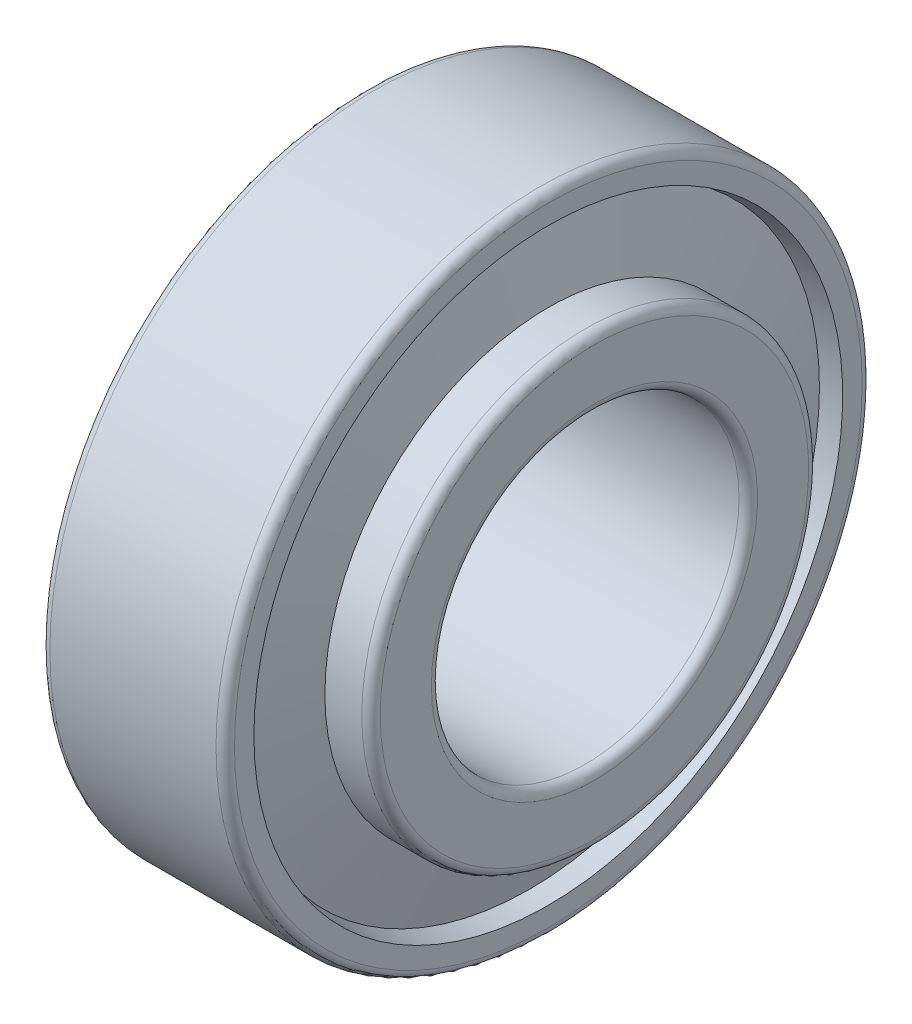
ISO-10303-21;
HEADER;
FILE_DESCRIPTION(('STEP AP214'),'2;1');
FILE_NAME('part.step','',(''),(''),'','','');
FILE_SCHEMA(('AUTOMOTIVE_DESIGN { 1 0 10303 214 1 1 1 1 }'));
ENDSEC;
DATA;
#1=APPLICATION_CONTEXT('core data for automotive mechanical design processes');
#2=APPLICATION_PROTOCOL_DEFINITION('international standard','automotive_design',2000,#1);
#3=PRODUCT_CONTEXT('',#1,'mechanical');
#4=PRODUCT('Part','Part','',(#3));
#5=PRODUCT_RELATED_PRODUCT_CATEGORY('part','',(#4));
#6=PRODUCT_DEFINITION_FORMATION('','',#4);
#7=PRODUCT_DEFINITION_CONTEXT('part definition',#1,'design');
#8=PRODUCT_DEFINITION('design','',#6,#7);
#9=PRODUCT_DEFINITION_SHAPE('','',#8);
#10=(LENGTH_UNIT() NAMED_UNIT(*) SI_UNIT(.MILLI.,.METRE.));
#11=(NAMED_UNIT(*) PLANE_ANGLE_UNIT() SI_UNIT($,.RADIAN.));
#12=(NAMED_UNIT(*) SI_UNIT($,.STERADIAN.) SOLID_ANGLE_UNIT());
#13=UNCERTAINTY_MEASURE_WITH_UNIT(LENGTH_MEASURE(1.E-05),#10,'distance_accuracy_value','');
#14=(GEOMETRIC_REPRESENTATION_CONTEXT(3) GLOBAL_UNCERTAINTY_ASSIGNED_CONTEXT((#13)) GLOBAL_UNIT_ASSIGNED_CONTEXT((#10,
#11,#12)) REPRESENTATION_CONTEXT('',''));
#15=CARTESIAN_POINT('',(0.,0.,0.));
#16=DIRECTION('',(0.,0.,1.));
#17=DIRECTION('',(1.,0.,0.));
#18=AXIS2_PLACEMENT_3D('',#15,#16,#17);
#19=CARTESIAN_POINT('',(1.32004780472916,0.,0.));
#20=DIRECTION('',(-1.,0.,0.));
#21=DIRECTION('',(0.,0.,1.));
#22=AXIS2_PLACEMENT_3D('',#19,#20,#21);
#23=CONICAL_SURFACE('',#22,16.6927755184011,1.32645023151569);
#24=CARTESIAN_POINT('',(2.64009560945833,0.,0.));
#25=DIRECTION('',(-1.,0.,0.));
#26=DIRECTION('',(0.,0.,1.));
#27=AXIS2_PLACEMENT_3D('',#24,#25,#26);
#28=CIRCLE('',#27,11.3983529518375);
#29=CARTESIAN_POINT('',(2.64009560945833,0.,11.3983529518375));
#30=VERTEX_POINT('',#29);
#31=EDGE_CURVE('E112',#30,#30,#28,.T.);
#32=ORIENTED_EDGE('',*,*,#31,.F.);
#33=EDGE_LOOP('',(#32));
#34=FACE_BOUND('',#33,.T.);
#35=CARTESIAN_POINT('',(1.32004780472916,0.,0.));
#36=DIRECTION('',(-1.,0.,0.));
#37=DIRECTION('',(0.,0.,1.));
#38=AXIS2_PLACEMENT_3D('',#35,#36,#37);
#39=CIRCLE('',#38,16.6927755184011);
#40=CARTESIAN_POINT('',(1.32004780472916,0.,16.6927755184011));
#41=VERTEX_POINT('',#40);
#42=EDGE_CURVE('E10',#41,#41,#39,.T.);
#43=ORIENTED_EDGE('',*,*,#42,.T.);
#44=EDGE_LOOP('',(#43));
#45=FACE_BOUND('',#44,.T.);
#46=ADVANCED_FACE('F37',(#34,#45),#23,.F.);
#47=CARTESIAN_POINT('',(0.,0.,0.));
#48=DIRECTION('',(1.,0.,0.));
#49=DIRECTION('',(0.,0.,-1.));
#50=AXIS2_PLACEMENT_3D('',#47,#48,#49);
#51=CONICAL_SURFACE('',#50,16.3905,0.225107317197011);
#52=ORIENTED_EDGE('',*,*,#42,.F.);
#53=EDGE_LOOP('',(#52));
#54=FACE_BOUND('',#53,.T.);
#55=CARTESIAN_POINT('',(0.,0.,0.));
#56=DIRECTION('',(-1.,0.,0.));
#57=DIRECTION('',(0.,0.,1.));
#58=AXIS2_PLACEMENT_3D('',#55,#56,#57);
#59=CIRCLE('',#58,16.3905);
#60=CARTESIAN_POINT('',(0.,0.,16.3905));
#61=VERTEX_POINT('',#60);
#62=EDGE_CURVE('E44',#61,#61,#59,.T.);
#63=ORIENTED_EDGE('',*,*,#62,.T.);
#64=EDGE_LOOP('',(#63));
#65=FACE_BOUND('',#64,.T.);
#66=ADVANCED_FACE('F120',(#54,#65),#51,.F.);
#67=CARTESIAN_POINT('',(0.,16.3905,0.));
#68=DIRECTION('',(1.,0.,0.));
#69=DIRECTION('',(0.,0.,-1.));
#70=AXIS2_PLACEMENT_3D('',#67,#68,#69);
#71=PLANE('',#70);
#72=ORIENTED_EDGE('',*,*,#62,.F.);
#73=EDGE_LOOP('',(#72));
#74=FACE_BOUND('',#73,.T.);
#75=CARTESIAN_POINT('',(0.,0.,0.));
#76=DIRECTION('',(-1.,0.,0.));
#77=DIRECTION('',(0.,0.,1.));
#78=AXIS2_PLACEMENT_3D('',#75,#76,#77);
#79=CIRCLE('',#78,20.4);
#80=CARTESIAN_POINT('',(0.,0.,20.4));
#81=VERTEX_POINT('',#80);
#82=EDGE_CURVE('E49',#81,#81,#79,.T.);
#83=ORIENTED_EDGE('',*,*,#82,.T.);
#84=EDGE_LOOP('',(#83));
#85=FACE_BOUND('',#84,.T.);
#86=ADVANCED_FACE('F124',(#74,#85),#71,.F.);
#87=CARTESIAN_POINT('',(0.6,0.,0.));
#88=DIRECTION('',(-1.,0.,0.));
#89=DIRECTION('',(0.,0.,1.));
#90=AXIS2_PLACEMENT_3D('',#87,#88,#89);
#91=TOROIDAL_SURFACE('',#90,20.4,0.599999999999995);
#92=ORIENTED_EDGE('',*,*,#82,.F.);
#93=EDGE_LOOP('',(#92));
#94=FACE_BOUND('',#93,.T.);
#95=CARTESIAN_POINT('',(0.600000000000045,0.,0.));
#96=DIRECTION('',(-1.,0.,0.));
#97=DIRECTION('',(0.,0.,1.));
#98=AXIS2_PLACEMENT_3D('',#95,#96,#97);
#99=CIRCLE('',#98,21.);
#100=CARTESIAN_POINT('',(0.600000000000045,0.,21.));
#101=VERTEX_POINT('',#100);
#102=EDGE_CURVE('E54',#101,#101,#99,.T.);
#103=ORIENTED_EDGE('',*,*,#102,.T.);
#104=EDGE_LOOP('',(#103));
#105=FACE_BOUND('',#104,.T.);
#106=ADVANCED_FACE('F129',(#94,#105),#91,.T.);
#107=CARTESIAN_POINT('',(-882.527700014444,0.,0.));
#108=DIRECTION('',(-1.,0.,0.));
#109=DIRECTION('',(0.,0.,1.));
#110=AXIS2_PLACEMENT_3D('',#107,#108,#109);
#111=CYLINDRICAL_SURFACE('',#110,21.);
#112=ORIENTED_EDGE('',*,*,#102,.F.);
#113=EDGE_LOOP('',(#112));
#114=FACE_BOUND('',#113,.T.);
#115=CARTESIAN_POINT('',(11.4,0.,0.));
#116=DIRECTION('',(-1.,0.,0.));
#117=DIRECTION('',(0.,0.,1.));
#118=AXIS2_PLACEMENT_3D('',#115,#116,#117);
#119=CIRCLE('',#118,21.);
#120=CARTESIAN_POINT('',(11.4,0.,21.));
#121=VERTEX_POINT('',#120);
#122=EDGE_CURVE('E60',#121,#121,#119,.T.);
#123=ORIENTED_EDGE('',*,*,#122,.T.);
#124=EDGE_LOOP('',(#123));
#125=FACE_BOUND('',#124,.T.);
#126=ADVANCED_FACE('F135',(#114,#125),#111,.T.);
#127=CARTESIAN_POINT('',(11.4,0.,0.));
#128=DIRECTION('',(-1.,0.,0.));
#129=DIRECTION('',(0.,0.,1.));
#130=AXIS2_PLACEMENT_3D('',#127,#128,#129);
#131=TOROIDAL_SURFACE('',#130,20.4,0.600000000000007);
#132=ORIENTED_EDGE('',*,*,#122,.F.);
#133=EDGE_LOOP('',(#132));
#134=FACE_BOUND('',#133,.T.);
#135=CARTESIAN_POINT('',(12.,0.,0.));
#136=DIRECTION('',(-1.,0.,0.));
#137=DIRECTION('',(0.,0.,1.));
#138=AXIS2_PLACEMENT_3D('',#135,#136,#137);
#139=CIRCLE('',#138,20.4);
#140=CARTESIAN_POINT('',(12.,0.,20.4));
#141=VERTEX_POINT('',#140);
#142=EDGE_CURVE('E64',#141,#141,#139,.T.);
#143=ORIENTED_EDGE('',*,*,#142,.T.);
#144=EDGE_LOOP('',(#143));
#145=FACE_BOUND('',#144,.T.);
#146=ADVANCED_FACE('F139',(#134,#145),#131,.T.);
#147=CARTESIAN_POINT('',(12.,20.4,0.));
#148=DIRECTION('',(-1.,0.,0.));
#149=DIRECTION('',(0.,0.,1.));
#150=AXIS2_PLACEMENT_3D('',#147,#148,#149);
#151=PLANE('',#150);
#152=ORIENTED_EDGE('',*,*,#142,.F.);
#153=EDGE_LOOP('',(#152));
#154=FACE_BOUND('',#153,.T.);
#155=CARTESIAN_POINT('',(12.,0.,0.));
#156=DIRECTION('',(-1.,0.,0.));
#157=DIRECTION('',(0.,0.,1.));
#158=AXIS2_PLACEMENT_3D('',#155,#156,#157);
#159=CIRCLE('',#158,19.1383597425166);
#160=CARTESIAN_POINT('',(12.,0.,19.1383597425166));
#161=VERTEX_POINT('',#160);
#162=EDGE_CURVE('E68',#161,#161,#159,.T.);
#163=ORIENTED_EDGE('',*,*,#162,.T.);
#164=EDGE_LOOP('',(#163));
#165=FACE_BOUND('',#164,.T.);
#166=ADVANCED_FACE('F143',(#154,#165),#151,.F.);
#167=CARTESIAN_POINT('',(10.7701907264873,0.,0.));
#168=DIRECTION('',(1.,0.,0.));
#169=DIRECTION('',(0.,0.,-1.));
#170=AXIS2_PLACEMENT_3D('',#167,#168,#169);
#171=CONICAL_SURFACE('',#170,18.856747793045,0.225107317197014);
#172=ORIENTED_EDGE('',*,*,#162,.F.);
#173=EDGE_LOOP('',(#172));
#174=FACE_BOUND('',#173,.T.);
#175=CARTESIAN_POINT('',(10.7701907264873,0.,0.));
#176=DIRECTION('',(-1.,0.,0.));
#177=DIRECTION('',(0.,0.,1.));
#178=AXIS2_PLACEMENT_3D('',#175,#176,#177);
#179=CIRCLE('',#178,18.856747793045);
#180=CARTESIAN_POINT('',(10.7701907264873,0.,18.856747793045));
#181=VERTEX_POINT('',#180);
#182=EDGE_CURVE('E72',#181,#181,#179,.T.);
#183=ORIENTED_EDGE('',*,*,#182,.T.);
#184=EDGE_LOOP('',(#183));
#185=FACE_BOUND('',#184,.T.);
#186=ADVANCED_FACE('F147',(#174,#185),#171,.F.);
#187=CARTESIAN_POINT('',(12.,0.,0.));
#188=DIRECTION('',(-1.,0.,0.));
#189=DIRECTION('',(0.,0.,1.));
#190=AXIS2_PLACEMENT_3D('',#187,#188,#189);
#191=CONICAL_SURFACE('',#190,13.924252206955,1.32645023151568);
#192=ORIENTED_EDGE('',*,*,#182,.F.);
#193=EDGE_LOOP('',(#192));
#194=FACE_BOUND('',#193,.T.);
#195=CARTESIAN_POINT('',(12.,0.,0.));
#196=DIRECTION('',(-1.,0.,0.));
#197=DIRECTION('',(0.,0.,1.));
#198=AXIS2_PLACEMENT_3D('',#195,#196,#197);
#199=CIRCLE('',#198,13.924252206955);
#200=CARTESIAN_POINT('',(12.,0.,13.924252206955));
#201=VERTEX_POINT('',#200);
#202=EDGE_CURVE('E76',#201,#201,#199,.T.);
#203=ORIENTED_EDGE('',*,*,#202,.T.);
#204=EDGE_LOOP('',(#203));
#205=FACE_BOUND('',#204,.T.);
#206=ADVANCED_FACE('F151',(#194,#205),#191,.T.);
#207=CARTESIAN_POINT('',(12.,14.524252206955,0.));
#208=DIRECTION('',(1.,0.,0.));
#209=DIRECTION('',(0.,0.,-1.));
#210=AXIS2_PLACEMENT_3D('',#207,#208,#209);
#211=PLANE('',#210);
#212=ORIENTED_EDGE('',*,*,#202,.F.);
#213=EDGE_LOOP('',(#212));
#214=FACE_BOUND('',#213,.T.);
#215=CARTESIAN_POINT('',(12.,0.,0.));
#216=DIRECTION('',(-1.,0.,0.));
#217=DIRECTION('',(0.,0.,1.));
#218=AXIS2_PLACEMENT_3D('',#215,#216,#217);
#219=CIRCLE('',#218,14.524252206955);
#220=CARTESIAN_POINT('',(12.,0.,14.524252206955));
#221=VERTEX_POINT('',#220);
#222=EDGE_CURVE('E80',#221,#221,#219,.T.);
#223=ORIENTED_EDGE('',*,*,#222,.T.);
#224=EDGE_LOOP('',(#223));
#225=FACE_BOUND('',#224,.T.);
#226=ADVANCED_FACE('F155',(#214,#225),#211,.F.);
#227=CARTESIAN_POINT('',(-882.527700014444,0.,0.));
#228=DIRECTION('',(-1.,0.,0.));
#229=DIRECTION('',(0.,0.,1.));
#230=AXIS2_PLACEMENT_3D('',#227,#228,#229);
#231=CYLINDRICAL_SURFACE('',#230,14.524252206955);
#232=ORIENTED_EDGE('',*,*,#222,.F.);
#233=EDGE_LOOP('',(#232));
#234=FACE_BOUND('',#233,.T.);
#235=CARTESIAN_POINT('',(14.4,0.,0.));
#236=DIRECTION('',(-1.,0.,0.));
#237=DIRECTION('',(0.,0.,1.));
#238=AXIS2_PLACEMENT_3D('',#235,#236,#237);
#239=CIRCLE('',#238,14.524252206955);
#240=CARTESIAN_POINT('',(14.4,0.,14.524252206955));
#241=VERTEX_POINT('',#240);
#242=EDGE_CURVE('E84',#241,#241,#239,.T.);
#243=ORIENTED_EDGE('',*,*,#242,.T.);
#244=EDGE_LOOP('',(#243));
#245=FACE_BOUND('',#244,.T.);
#246=ADVANCED_FACE('F159',(#234,#245),#231,.T.);
#247=CARTESIAN_POINT('',(14.4,0.,0.));
#248=DIRECTION('',(-1.,0.,0.));
#249=DIRECTION('',(0.,0.,1.));
#250=AXIS2_PLACEMENT_3D('',#247,#248,#249);
#251=TOROIDAL_SURFACE('',#250,13.924252206955,0.599999999999996);
#252=ORIENTED_EDGE('',*,*,#242,.F.);
#253=EDGE_LOOP('',(#252));
#254=FACE_BOUND('',#253,.T.);
#255=CARTESIAN_POINT('',(15.,0.,0.));
#256=DIRECTION('',(-1.,0.,0.));
#257=DIRECTION('',(0.,0.,1.));
#258=AXIS2_PLACEMENT_3D('',#255,#256,#257);
#259=CIRCLE('',#258,13.924252206955);
#260=CARTESIAN_POINT('',(15.,0.,13.924252206955));
#261=VERTEX_POINT('',#260);
#262=EDGE_CURVE('E88',#261,#261,#259,.T.);
#263=ORIENTED_EDGE('',*,*,#262,.T.);
#264=EDGE_LOOP('',(#263));
#265=FACE_BOUND('',#264,.T.);
#266=ADVANCED_FACE('F163',(#254,#265),#251,.T.);
#267=CARTESIAN_POINT('',(15.,10.6,0.));
#268=DIRECTION('',(-1.,0.,0.));
#269=DIRECTION('',(0.,0.,1.));
#270=AXIS2_PLACEMENT_3D('',#267,#268,#269);
#271=PLANE('',#270);
#272=ORIENTED_EDGE('',*,*,#262,.F.);
#273=EDGE_LOOP('',(#272));
#274=FACE_BOUND('',#273,.T.);
#275=CARTESIAN_POINT('',(15.,0.,0.));
#276=DIRECTION('',(-1.,0.,0.));
#277=DIRECTION('',(0.,0.,1.));
#278=AXIS2_PLACEMENT_3D('',#275,#276,#277);
#279=CIRCLE('',#278,10.6);
#280=CARTESIAN_POINT('',(15.,0.,10.6));
#281=VERTEX_POINT('',#280);
#282=EDGE_CURVE('E92',#281,#281,#279,.T.);
#283=ORIENTED_EDGE('',*,*,#282,.T.);
#284=EDGE_LOOP('',(#283));
#285=FACE_BOUND('',#284,.T.);
#286=ADVANCED_FACE('F167',(#274,#285),#271,.F.);
#287=CARTESIAN_POINT('',(14.4,0.,0.));
#288=DIRECTION('',(-1.,0.,0.));
#289=DIRECTION('',(0.,0.,1.));
#290=AXIS2_PLACEMENT_3D('',#287,#288,#289);
#291=TOROIDAL_SURFACE('',#290,10.6,0.599999999999996);
#292=ORIENTED_EDGE('',*,*,#282,.F.);
#293=EDGE_LOOP('',(#292));
#294=FACE_BOUND('',#293,.T.);
#295=CARTESIAN_POINT('',(14.4,0.,0.));
#296=DIRECTION('',(-1.,0.,0.));
#297=DIRECTION('',(0.,0.,1.));
#298=AXIS2_PLACEMENT_3D('',#295,#296,#297);
#299=CIRCLE('',#298,10.);
#300=CARTESIAN_POINT('',(14.4,0.,10.));
#301=VERTEX_POINT('',#300);
#302=EDGE_CURVE('E96',#301,#301,#299,.T.);
#303=ORIENTED_EDGE('',*,*,#302,.T.);
#304=EDGE_LOOP('',(#303));
#305=FACE_BOUND('',#304,.T.);
#306=ADVANCED_FACE('F171',(#294,#305),#291,.T.);
#307=CARTESIAN_POINT('',(-882.527700014444,0.,0.));
#308=DIRECTION('',(-1.,0.,0.));
#309=DIRECTION('',(0.,0.,1.));
#310=AXIS2_PLACEMENT_3D('',#307,#308,#309);
#311=CYLINDRICAL_SURFACE('',#310,10.);
#312=ORIENTED_EDGE('',*,*,#302,.F.);
#313=EDGE_LOOP('',(#312));
#314=FACE_BOUND('',#313,.T.);
#315=CARTESIAN_POINT('',(0.600000000000045,0.,0.));
#316=DIRECTION('',(-1.,0.,0.));
#317=DIRECTION('',(0.,0.,1.));
#318=AXIS2_PLACEMENT_3D('',#315,#316,#317);
#319=CIRCLE('',#318,10.);
#320=CARTESIAN_POINT('',(0.600000000000045,0.,10.));
#321=VERTEX_POINT('',#320);
#322=EDGE_CURVE('E100',#321,#321,#319,.T.);
#323=ORIENTED_EDGE('',*,*,#322,.T.);
#324=EDGE_LOOP('',(#323));
#325=FACE_BOUND('',#324,.T.);
#326=ADVANCED_FACE('F175',(#314,#325),#311,.F.);
#327=CARTESIAN_POINT('',(0.6,0.,0.));
#328=DIRECTION('',(-1.,0.,0.));
#329=DIRECTION('',(0.,0.,1.));
#330=AXIS2_PLACEMENT_3D('',#327,#328,#329);
#331=TOROIDAL_SURFACE('',#330,10.6,0.600000000000008);
#332=ORIENTED_EDGE('',*,*,#322,.F.);
#333=EDGE_LOOP('',(#332));
#334=FACE_BOUND('',#333,.T.);
#335=CARTESIAN_POINT('',(0.,0.,0.));
#336=DIRECTION('',(-1.,0.,0.));
#337=DIRECTION('',(0.,0.,1.));
#338=AXIS2_PLACEMENT_3D('',#335,#336,#337);
#339=CIRCLE('',#338,10.6);
#340=CARTESIAN_POINT('',(0.,0.,10.6));
#341=VERTEX_POINT('',#340);
#342=EDGE_CURVE('E104',#341,#341,#339,.T.);
#343=ORIENTED_EDGE('',*,*,#342,.T.);
#344=EDGE_LOOP('',(#343));
#345=FACE_BOUND('',#344,.T.);
#346=ADVANCED_FACE('F179',(#334,#345),#331,.T.);
#347=CARTESIAN_POINT('',(0.,11.3983529518375,0.));
#348=DIRECTION('',(1.,0.,0.));
#349=DIRECTION('',(0.,0.,-1.));
#350=AXIS2_PLACEMENT_3D('',#347,#348,#349);
#351=PLANE('',#350);
#352=ORIENTED_EDGE('',*,*,#342,.F.);
#353=EDGE_LOOP('',(#352));
#354=FACE_BOUND('',#353,.T.);
#355=CARTESIAN_POINT('',(0.,0.,0.));
#356=DIRECTION('',(-1.,0.,0.));
#357=DIRECTION('',(0.,0.,1.));
#358=AXIS2_PLACEMENT_3D('',#355,#356,#357);
#359=CIRCLE('',#358,11.3983529518375);
#360=CARTESIAN_POINT('',(0.,0.,11.3983529518375));
#361=VERTEX_POINT('',#360);
#362=EDGE_CURVE('E108',#361,#361,#359,.T.);
#363=ORIENTED_EDGE('',*,*,#362,.T.);
#364=EDGE_LOOP('',(#363));
#365=FACE_BOUND('',#364,.T.);
#366=ADVANCED_FACE('F183',(#354,#365),#351,.F.);
#367=CARTESIAN_POINT('',(-882.527700014444,0.,0.));
#368=DIRECTION('',(-1.,0.,0.));
#369=DIRECTION('',(0.,0.,1.));
#370=AXIS2_PLACEMENT_3D('',#367,#368,#369);
#371=CYLINDRICAL_SURFACE('',#370,11.3983529518375);
#372=ORIENTED_EDGE('',*,*,#362,.F.);
#373=EDGE_LOOP('',(#372));
#374=FACE_BOUND('',#373,.T.);
#375=ORIENTED_EDGE('',*,*,#31,.T.);
#376=EDGE_LOOP('',(#375));
#377=FACE_BOUND('',#376,.T.);
#378=ADVANCED_FACE('F117',(#374,#377),#371,.T.);
#379=CLOSED_SHELL('',(#46,#66,#86,#106,#126,#146,#166,#186,#206,#226,#246,#266,#286,#306,#326,
#346,#366,#378));
#380=MANIFOLD_SOLID_BREP('B2',#379);
#381=ADVANCED_BREP_SHAPE_REPRESENTATION('',(#18,#380),#14);
#382=SHAPE_DEFINITION_REPRESENTATION(#9,#381);
ENDSEC;
END-ISO-10303-21;
